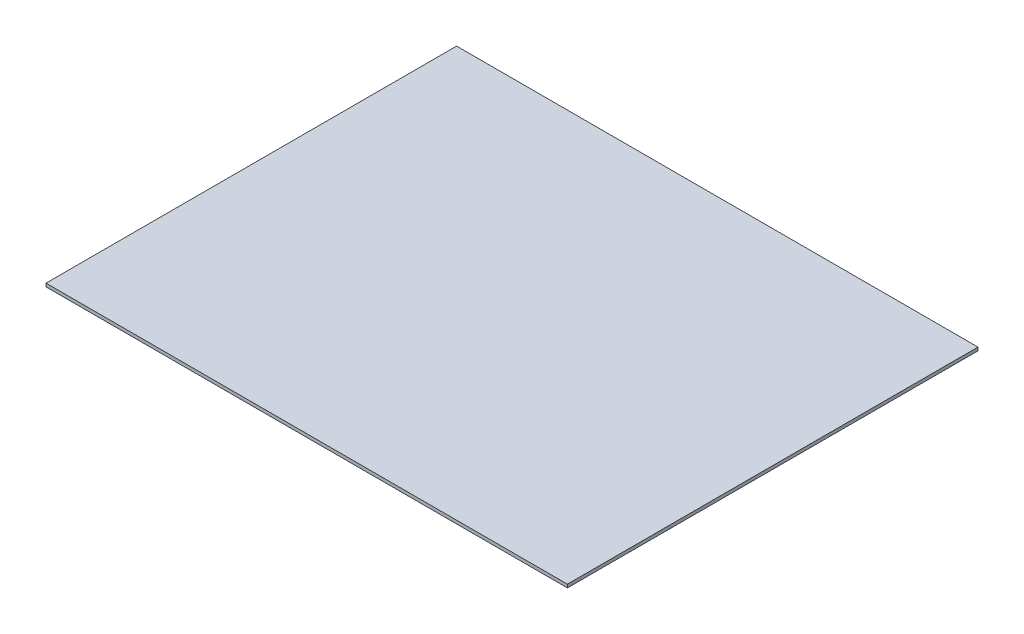
ISO-10303-21;
HEADER;
FILE_DESCRIPTION(('STEP AP214'),'2;1');
FILE_NAME('part.step','',(''),(''),'','','');
FILE_SCHEMA(('AUTOMOTIVE_DESIGN { 1 0 10303 214 1 1 1 1 }'));
ENDSEC;
DATA;
#1=APPLICATION_CONTEXT('core data for automotive mechanical design processes');
#2=APPLICATION_PROTOCOL_DEFINITION('international standard','automotive_design',2000,#1);
#3=PRODUCT_CONTEXT('',#1,'mechanical');
#4=PRODUCT('Part','Part','',(#3));
#5=PRODUCT_RELATED_PRODUCT_CATEGORY('part','',(#4));
#6=PRODUCT_DEFINITION_FORMATION('','',#4);
#7=PRODUCT_DEFINITION_CONTEXT('part definition',#1,'design');
#8=PRODUCT_DEFINITION('design','',#6,#7);
#9=PRODUCT_DEFINITION_SHAPE('','',#8);
#10=(LENGTH_UNIT() NAMED_UNIT(*) SI_UNIT(.MILLI.,.METRE.));
#11=(NAMED_UNIT(*) PLANE_ANGLE_UNIT() SI_UNIT($,.RADIAN.));
#12=(NAMED_UNIT(*) SI_UNIT($,.STERADIAN.) SOLID_ANGLE_UNIT());
#13=UNCERTAINTY_MEASURE_WITH_UNIT(LENGTH_MEASURE(1.E-05),#10,'distance_accuracy_value','');
#14=(GEOMETRIC_REPRESENTATION_CONTEXT(3) GLOBAL_UNCERTAINTY_ASSIGNED_CONTEXT((#13)) GLOBAL_UNIT_ASSIGNED_CONTEXT((#10,
#11,#12)) REPRESENTATION_CONTEXT('',''));
#15=CARTESIAN_POINT('',(0.,0.,0.));
#16=DIRECTION('',(0.,0.,1.));
#17=DIRECTION('',(1.,0.,0.));
#18=AXIS2_PLACEMENT_3D('',#15,#16,#17);
#19=CARTESIAN_POINT('',(0.,12.7,0.));
#20=DIRECTION('',(1.,0.,0.));
#21=DIRECTION('',(0.,0.,-1.));
#22=AXIS2_PLACEMENT_3D('',#19,#20,#21);
#23=PLANE('',#22);
#24=DIRECTION('',(0.,0.,1.));
#25=VECTOR('',#24,1.);
#26=CARTESIAN_POINT('',(0.,0.,0.));
#27=LINE('',#26,#25);
#28=CARTESIAN_POINT('',(0.,0.,-1600.2));
#29=VERTEX_POINT('',#28);
#30=CARTESIAN_POINT('',(0.,0.,0.));
#31=VERTEX_POINT('',#30);
#32=EDGE_CURVE('E95',#29,#31,#27,.T.);
#33=ORIENTED_EDGE('',*,*,#32,.T.);
#34=DIRECTION('',(0.,-1.,0.));
#35=VECTOR('',#34,1.);
#36=CARTESIAN_POINT('',(0.,12.7,0.));
#37=LINE('',#36,#35);
#38=CARTESIAN_POINT('',(0.,12.7,0.));
#39=VERTEX_POINT('',#38);
#40=EDGE_CURVE('E11',#39,#31,#37,.T.);
#41=ORIENTED_EDGE('',*,*,#40,.F.);
#42=DIRECTION('',(0.,0.,1.));
#43=VECTOR('',#42,1.);
#44=CARTESIAN_POINT('',(0.,12.7,0.));
#45=LINE('',#44,#43);
#46=CARTESIAN_POINT('',(0.,12.7,-1600.2));
#47=VERTEX_POINT('',#46);
#48=EDGE_CURVE('E83',#47,#39,#45,.T.);
#49=ORIENTED_EDGE('',*,*,#48,.F.);
#50=DIRECTION('',(0.,-1.,0.));
#51=VECTOR('',#50,1.);
#52=CARTESIAN_POINT('',(0.,12.7,-1600.2));
#53=LINE('',#52,#51);
#54=EDGE_CURVE('E91',#47,#29,#53,.T.);
#55=ORIENTED_EDGE('',*,*,#54,.T.);
#56=EDGE_LOOP('',(#33,#41,#49,#55));
#57=FACE_BOUND('',#56,.T.);
#58=ADVANCED_FACE('F32',(#57),#23,.F.);
#59=CARTESIAN_POINT('',(0.,12.7,0.));
#60=DIRECTION('',(0.,0.,-1.));
#61=DIRECTION('',(-1.,0.,0.));
#62=AXIS2_PLACEMENT_3D('',#59,#60,#61);
#63=PLANE('',#62);
#64=DIRECTION('',(1.,0.,0.));
#65=VECTOR('',#64,1.);
#66=CARTESIAN_POINT('',(0.,0.,0.));
#67=LINE('',#66,#65);
#68=CARTESIAN_POINT('',(2032.,0.,0.));
#69=VERTEX_POINT('',#68);
#70=EDGE_CURVE('E87',#31,#69,#67,.T.);
#71=ORIENTED_EDGE('',*,*,#70,.T.);
#72=DIRECTION('',(0.,-1.,0.));
#73=VECTOR('',#72,1.);
#74=CARTESIAN_POINT('',(2032.,12.7,0.));
#75=LINE('',#74,#73);
#76=CARTESIAN_POINT('',(2032.,12.7,0.));
#77=VERTEX_POINT('',#76);
#78=EDGE_CURVE('E40',#77,#69,#75,.T.);
#79=ORIENTED_EDGE('',*,*,#78,.F.);
#80=DIRECTION('',(1.,0.,0.));
#81=VECTOR('',#80,1.);
#82=CARTESIAN_POINT('',(0.,12.7,0.));
#83=LINE('',#82,#81);
#84=EDGE_CURVE('E78',#39,#77,#83,.T.);
#85=ORIENTED_EDGE('',*,*,#84,.F.);
#86=ORIENTED_EDGE('',*,*,#40,.T.);
#87=EDGE_LOOP('',(#71,#79,#85,#86));
#88=FACE_BOUND('',#87,.T.);
#89=ADVANCED_FACE('F86',(#88),#63,.F.);
#90=CARTESIAN_POINT('',(2032.,12.7,0.));
#91=DIRECTION('',(-1.,0.,0.));
#92=DIRECTION('',(0.,0.,1.));
#93=AXIS2_PLACEMENT_3D('',#90,#91,#92);
#94=PLANE('',#93);
#95=DIRECTION('',(0.,0.,-1.));
#96=VECTOR('',#95,1.);
#97=CARTESIAN_POINT('',(2032.,0.,0.));
#98=LINE('',#97,#96);
#99=CARTESIAN_POINT('',(2032.,0.,-1600.2));
#100=VERTEX_POINT('',#99);
#101=EDGE_CURVE('E65',#69,#100,#98,.T.);
#102=ORIENTED_EDGE('',*,*,#101,.T.);
#103=DIRECTION('',(0.,-1.,0.));
#104=VECTOR('',#103,1.);
#105=CARTESIAN_POINT('',(2032.,12.7,-1600.2));
#106=LINE('',#105,#104);
#107=CARTESIAN_POINT('',(2032.,12.7,-1600.2));
#108=VERTEX_POINT('',#107);
#109=EDGE_CURVE('E88',#108,#100,#106,.T.);
#110=ORIENTED_EDGE('',*,*,#109,.F.);
#111=DIRECTION('',(0.,0.,-1.));
#112=VECTOR('',#111,1.);
#113=CARTESIAN_POINT('',(2032.,12.7,0.));
#114=LINE('',#113,#112);
#115=EDGE_CURVE('E81',#77,#108,#114,.T.);
#116=ORIENTED_EDGE('',*,*,#115,.F.);
#117=ORIENTED_EDGE('',*,*,#78,.T.);
#118=EDGE_LOOP('',(#102,#110,#116,#117));
#119=FACE_BOUND('',#118,.T.);
#120=ADVANCED_FACE('F89',(#119),#94,.F.);
#121=CARTESIAN_POINT('',(0.,12.7,-1600.2));
#122=DIRECTION('',(0.,0.,1.));
#123=DIRECTION('',(1.,0.,0.));
#124=AXIS2_PLACEMENT_3D('',#121,#122,#123);
#125=PLANE('',#124);
#126=DIRECTION('',(-1.,0.,0.));
#127=VECTOR('',#126,1.);
#128=CARTESIAN_POINT('',(0.,0.,-1600.2));
#129=LINE('',#128,#127);
#130=EDGE_CURVE('E71',#100,#29,#129,.T.);
#131=ORIENTED_EDGE('',*,*,#130,.T.);
#132=ORIENTED_EDGE('',*,*,#54,.F.);
#133=DIRECTION('',(-1.,0.,0.));
#134=VECTOR('',#133,1.);
#135=CARTESIAN_POINT('',(0.,12.7,-1600.2));
#136=LINE('',#135,#134);
#137=EDGE_CURVE('E48',#108,#47,#136,.T.);
#138=ORIENTED_EDGE('',*,*,#137,.F.);
#139=ORIENTED_EDGE('',*,*,#109,.T.);
#140=EDGE_LOOP('',(#131,#132,#138,#139));
#141=FACE_BOUND('',#140,.T.);
#142=ADVANCED_FACE('F102',(#141),#125,.F.);
#143=CARTESIAN_POINT('',(0.,12.7,0.));
#144=DIRECTION('',(0.,-1.,0.));
#145=DIRECTION('',(0.,0.,-1.));
#146=AXIS2_PLACEMENT_3D('',#143,#144,#145);
#147=PLANE('',#146);
#148=ORIENTED_EDGE('',*,*,#48,.T.);
#149=ORIENTED_EDGE('',*,*,#84,.T.);
#150=ORIENTED_EDGE('',*,*,#115,.T.);
#151=ORIENTED_EDGE('',*,*,#137,.T.);
#152=EDGE_LOOP('',(#148,#149,#150,#151));
#153=FACE_BOUND('',#152,.T.);
#154=ADVANCED_FACE('F79',(#153),#147,.F.);
#155=CARTESIAN_POINT('',(0.,0.,0.));
#156=DIRECTION('',(0.,-1.,0.));
#157=DIRECTION('',(0.,0.,-1.));
#158=AXIS2_PLACEMENT_3D('',#155,#156,#157);
#159=PLANE('',#158);
#160=ORIENTED_EDGE('',*,*,#32,.F.);
#161=ORIENTED_EDGE('',*,*,#130,.F.);
#162=ORIENTED_EDGE('',*,*,#101,.F.);
#163=ORIENTED_EDGE('',*,*,#70,.F.);
#164=EDGE_LOOP('',(#160,#161,#162,#163));
#165=FACE_BOUND('',#164,.T.);
#166=ADVANCED_FACE('F105',(#165),#159,.T.);
#167=CLOSED_SHELL('',(#58,#89,#120,#142,#154,#166));
#168=MANIFOLD_SOLID_BREP('B2',#167);
#169=ADVANCED_BREP_SHAPE_REPRESENTATION('',(#18,#168),#14);
#170=SHAPE_DEFINITION_REPRESENTATION(#9,#169);
ENDSEC;
END-ISO-10303-21;
